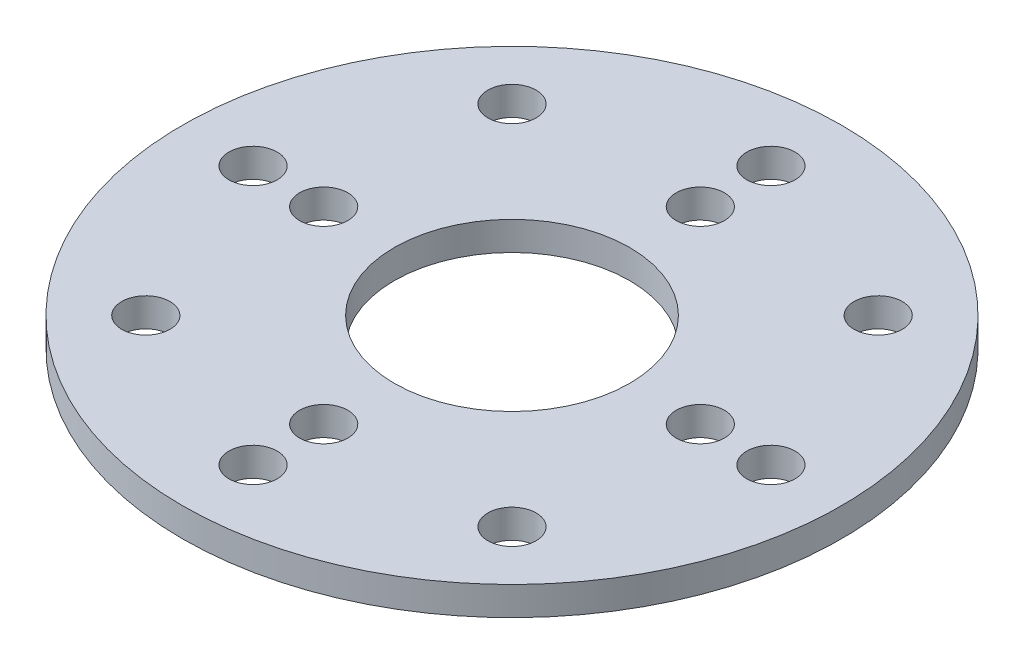
ISO-10303-21;
HEADER;
FILE_DESCRIPTION(('STEP AP214'),'2;1');
FILE_NAME('part.step','',(''),(''),'','','');
FILE_SCHEMA(('AUTOMOTIVE_DESIGN { 1 0 10303 214 1 1 1 1 }'));
ENDSEC;
DATA;
#1=APPLICATION_CONTEXT('core data for automotive mechanical design processes');
#2=APPLICATION_PROTOCOL_DEFINITION('international standard','automotive_design',2000,#1);
#3=PRODUCT_CONTEXT('',#1,'mechanical');
#4=PRODUCT('Part','Part','',(#3));
#5=PRODUCT_RELATED_PRODUCT_CATEGORY('part','',(#4));
#6=PRODUCT_DEFINITION_FORMATION('','',#4);
#7=PRODUCT_DEFINITION_CONTEXT('part definition',#1,'design');
#8=PRODUCT_DEFINITION('design','',#6,#7);
#9=PRODUCT_DEFINITION_SHAPE('','',#8);
#10=(LENGTH_UNIT() NAMED_UNIT(*) SI_UNIT(.MILLI.,.METRE.));
#11=(NAMED_UNIT(*) PLANE_ANGLE_UNIT() SI_UNIT($,.RADIAN.));
#12=(NAMED_UNIT(*) SI_UNIT($,.STERADIAN.) SOLID_ANGLE_UNIT());
#13=UNCERTAINTY_MEASURE_WITH_UNIT(LENGTH_MEASURE(1.E-05),#10,'distance_accuracy_value','');
#14=(GEOMETRIC_REPRESENTATION_CONTEXT(3) GLOBAL_UNCERTAINTY_ASSIGNED_CONTEXT((#13)) GLOBAL_UNIT_ASSIGNED_CONTEXT((#10,
#11,#12)) REPRESENTATION_CONTEXT('',''));
#15=CARTESIAN_POINT('',(0.,0.,0.));
#16=DIRECTION('',(0.,0.,1.));
#17=DIRECTION('',(1.,0.,0.));
#18=AXIS2_PLACEMENT_3D('',#15,#16,#17);
#19=CARTESIAN_POINT('',(0.,0.5,0.));
#20=DIRECTION('',(0.,1.,0.));
#21=DIRECTION('',(0.,0.,1.));
#22=AXIS2_PLACEMENT_3D('',#19,#20,#21);
#23=CYLINDRICAL_SURFACE('',#22,14.);
#24=CARTESIAN_POINT('',(0.,0.5,0.));
#25=DIRECTION('',(0.,1.,0.));
#26=DIRECTION('',(0.,0.,-1.));
#27=AXIS2_PLACEMENT_3D('',#24,#25,#26);
#28=CIRCLE('',#27,14.);
#29=CARTESIAN_POINT('',(0.,0.5,-14.));
#30=VERTEX_POINT('',#29);
#31=EDGE_CURVE('E10',#30,#30,#28,.T.);
#32=ORIENTED_EDGE('',*,*,#31,.T.);
#33=EDGE_LOOP('',(#32));
#34=FACE_BOUND('',#33,.T.);
#35=CARTESIAN_POINT('',(0.,1.72,0.));
#36=DIRECTION('',(0.,1.,0.));
#37=DIRECTION('',(0.,0.,-1.));
#38=AXIS2_PLACEMENT_3D('',#35,#36,#37);
#39=CIRCLE('',#38,14.);
#40=CARTESIAN_POINT('',(0.,1.72,-14.));
#41=VERTEX_POINT('',#40);
#42=EDGE_CURVE('E34',#41,#41,#39,.T.);
#43=ORIENTED_EDGE('',*,*,#42,.F.);
#44=EDGE_LOOP('',(#43));
#45=FACE_BOUND('',#44,.T.);
#46=ADVANCED_FACE('F31',(#34,#45),#23,.T.);
#47=CARTESIAN_POINT('',(0.,0.5,0.));
#48=DIRECTION('',(0.,-1.,0.));
#49=DIRECTION('',(0.,0.,-1.));
#50=AXIS2_PLACEMENT_3D('',#47,#48,#49);
#51=PLANE('',#50);
#52=CARTESIAN_POINT('',(0.,0.5,0.));
#53=DIRECTION('',(0.,1.,0.));
#54=DIRECTION('',(0.,0.,-1.));
#55=AXIS2_PLACEMENT_3D('',#52,#53,#54);
#56=CIRCLE('',#55,5.);
#57=CARTESIAN_POINT('',(0.,0.5,-5.));
#58=VERTEX_POINT('',#57);
#59=EDGE_CURVE('E112',#58,#58,#56,.T.);
#60=ORIENTED_EDGE('',*,*,#59,.T.);
#61=EDGE_LOOP('',(#60));
#62=FACE_BOUND('',#61,.T.);
#63=CARTESIAN_POINT('',(0.,0.5,8.));
#64=DIRECTION('',(0.,1.,0.));
#65=DIRECTION('',(0.,0.,-1.));
#66=AXIS2_PLACEMENT_3D('',#63,#64,#65);
#67=CIRCLE('',#66,1.02499999999999);
#68=CARTESIAN_POINT('',(0.,0.5,6.97500000000001));
#69=VERTEX_POINT('',#68);
#70=EDGE_CURVE('E106',#69,#69,#67,.T.);
#71=ORIENTED_EDGE('',*,*,#70,.T.);
#72=EDGE_LOOP('',(#71));
#73=FACE_BOUND('',#72,.T.);
#74=CARTESIAN_POINT('',(0.,0.5,-8.));
#75=DIRECTION('',(0.,1.,0.));
#76=DIRECTION('',(0.,0.,-1.));
#77=AXIS2_PLACEMENT_3D('',#74,#75,#76);
#78=CIRCLE('',#77,1.02499999999999);
#79=CARTESIAN_POINT('',(0.,0.5,-9.02499999999999));
#80=VERTEX_POINT('',#79);
#81=EDGE_CURVE('E100',#80,#80,#78,.T.);
#82=ORIENTED_EDGE('',*,*,#81,.T.);
#83=EDGE_LOOP('',(#82));
#84=FACE_BOUND('',#83,.T.);
#85=CARTESIAN_POINT('',(-11.,0.5,0.));
#86=DIRECTION('',(0.,1.,0.));
#87=DIRECTION('',(0.,0.,-1.));
#88=AXIS2_PLACEMENT_3D('',#85,#86,#87);
#89=CIRCLE('',#88,1.02499999999999);
#90=CARTESIAN_POINT('',(-11.,0.5,-1.02499999999999));
#91=VERTEX_POINT('',#90);
#92=EDGE_CURVE('E94',#91,#91,#89,.T.);
#93=ORIENTED_EDGE('',*,*,#92,.T.);
#94=EDGE_LOOP('',(#93));
#95=FACE_BOUND('',#94,.T.);
#96=CARTESIAN_POINT('',(0.,0.5,11.));
#97=DIRECTION('',(0.,1.,0.));
#98=DIRECTION('',(0.,0.,-1.));
#99=AXIS2_PLACEMENT_3D('',#96,#97,#98);
#100=CIRCLE('',#99,1.02499999999999);
#101=CARTESIAN_POINT('',(0.,0.5,9.97500000000001));
#102=VERTEX_POINT('',#101);
#103=EDGE_CURVE('E88',#102,#102,#100,.T.);
#104=ORIENTED_EDGE('',*,*,#103,.T.);
#105=EDGE_LOOP('',(#104));
#106=FACE_BOUND('',#105,.T.);
#107=CARTESIAN_POINT('',(11.,0.5,0.));
#108=DIRECTION('',(0.,1.,0.));
#109=DIRECTION('',(0.,0.,-1.));
#110=AXIS2_PLACEMENT_3D('',#107,#108,#109);
#111=CIRCLE('',#110,1.02499999999999);
#112=CARTESIAN_POINT('',(11.,0.5,-1.02499999999999));
#113=VERTEX_POINT('',#112);
#114=EDGE_CURVE('E82',#113,#113,#111,.T.);
#115=ORIENTED_EDGE('',*,*,#114,.T.);
#116=EDGE_LOOP('',(#115));
#117=FACE_BOUND('',#116,.T.);
#118=CARTESIAN_POINT('',(0.,0.5,-11.));
#119=DIRECTION('',(0.,1.,0.));
#120=DIRECTION('',(0.,0.,-1.));
#121=AXIS2_PLACEMENT_3D('',#118,#119,#120);
#122=CIRCLE('',#121,1.02499999999999);
#123=CARTESIAN_POINT('',(0.,0.5,-12.025));
#124=VERTEX_POINT('',#123);
#125=EDGE_CURVE('E76',#124,#124,#122,.T.);
#126=ORIENTED_EDGE('',*,*,#125,.T.);
#127=EDGE_LOOP('',(#126));
#128=FACE_BOUND('',#127,.T.);
#129=CARTESIAN_POINT('',(7.778174593052,0.5,-7.778174593052));
#130=DIRECTION('',(0.,1.,0.));
#131=DIRECTION('',(0.,0.,-1.));
#132=AXIS2_PLACEMENT_3D('',#129,#130,#131);
#133=CIRCLE('',#132,1.02499999999999);
#134=CARTESIAN_POINT('',(7.778174593052,0.5,-8.80317459305199));
#135=VERTEX_POINT('',#134);
#136=EDGE_CURVE('E70',#135,#135,#133,.T.);
#137=ORIENTED_EDGE('',*,*,#136,.T.);
#138=EDGE_LOOP('',(#137));
#139=FACE_BOUND('',#138,.T.);
#140=CARTESIAN_POINT('',(7.778174593052,0.5,7.778174593052));
#141=DIRECTION('',(0.,1.,0.));
#142=DIRECTION('',(0.,0.,-1.));
#143=AXIS2_PLACEMENT_3D('',#140,#141,#142);
#144=CIRCLE('',#143,1.02499999999999);
#145=CARTESIAN_POINT('',(7.778174593052,0.5,6.75317459305201));
#146=VERTEX_POINT('',#145);
#147=EDGE_CURVE('E64',#146,#146,#144,.T.);
#148=ORIENTED_EDGE('',*,*,#147,.T.);
#149=EDGE_LOOP('',(#148));
#150=FACE_BOUND('',#149,.T.);
#151=CARTESIAN_POINT('',(-7.778174593052,0.5,7.778174593052));
#152=DIRECTION('',(0.,1.,0.));
#153=DIRECTION('',(0.,0.,-1.));
#154=AXIS2_PLACEMENT_3D('',#151,#152,#153);
#155=CIRCLE('',#154,1.02499999999999);
#156=CARTESIAN_POINT('',(-7.778174593052,0.5,6.75317459305201));
#157=VERTEX_POINT('',#156);
#158=EDGE_CURVE('E58',#157,#157,#155,.T.);
#159=ORIENTED_EDGE('',*,*,#158,.T.);
#160=EDGE_LOOP('',(#159));
#161=FACE_BOUND('',#160,.T.);
#162=CARTESIAN_POINT('',(-7.778174593052,0.5,-7.778174593052));
#163=DIRECTION('',(0.,1.,0.));
#164=DIRECTION('',(0.,0.,-1.));
#165=AXIS2_PLACEMENT_3D('',#162,#163,#164);
#166=CIRCLE('',#165,1.02499999999999);
#167=CARTESIAN_POINT('',(-7.778174593052,0.5,-8.80317459305199));
#168=VERTEX_POINT('',#167);
#169=EDGE_CURVE('E52',#168,#168,#166,.T.);
#170=ORIENTED_EDGE('',*,*,#169,.T.);
#171=EDGE_LOOP('',(#170));
#172=FACE_BOUND('',#171,.T.);
#173=CARTESIAN_POINT('',(8.,0.5,0.));
#174=DIRECTION('',(0.,1.,0.));
#175=DIRECTION('',(0.,0.,-1.));
#176=AXIS2_PLACEMENT_3D('',#173,#174,#175);
#177=CIRCLE('',#176,1.02499999999999);
#178=CARTESIAN_POINT('',(8.,0.5,-1.02499999999999));
#179=VERTEX_POINT('',#178);
#180=EDGE_CURVE('E46',#179,#179,#177,.T.);
#181=ORIENTED_EDGE('',*,*,#180,.T.);
#182=EDGE_LOOP('',(#181));
#183=FACE_BOUND('',#182,.T.);
#184=CARTESIAN_POINT('',(-8.,0.5,0.));
#185=DIRECTION('',(0.,1.,0.));
#186=DIRECTION('',(0.,0.,-1.));
#187=AXIS2_PLACEMENT_3D('',#184,#185,#186);
#188=CIRCLE('',#187,1.02499999999999);
#189=CARTESIAN_POINT('',(-8.,0.5,-1.02499999999999));
#190=VERTEX_POINT('',#189);
#191=EDGE_CURVE('E41',#190,#190,#188,.T.);
#192=ORIENTED_EDGE('',*,*,#191,.T.);
#193=EDGE_LOOP('',(#192));
#194=FACE_BOUND('',#193,.T.);
#195=ORIENTED_EDGE('',*,*,#31,.F.);
#196=EDGE_LOOP('',(#195));
#197=FACE_BOUND('',#196,.T.);
#198=ADVANCED_FACE('F121',(#62,#73,#84,#95,#106,#117,#128,#139,#150,#161,#172,#183,#194,#197),
#51,.T.);
#199=CARTESIAN_POINT('',(0.,1.72,0.));
#200=DIRECTION('',(0.,-1.,0.));
#201=DIRECTION('',(0.,0.,-1.));
#202=AXIS2_PLACEMENT_3D('',#199,#200,#201);
#203=PLANE('',#202);
#204=CARTESIAN_POINT('',(0.,1.72,0.));
#205=DIRECTION('',(0.,1.,0.));
#206=DIRECTION('',(0.,0.,-1.));
#207=AXIS2_PLACEMENT_3D('',#204,#205,#206);
#208=CIRCLE('',#207,5.);
#209=CARTESIAN_POINT('',(0.,1.72,-5.));
#210=VERTEX_POINT('',#209);
#211=EDGE_CURVE('E115',#210,#210,#208,.T.);
#212=ORIENTED_EDGE('',*,*,#211,.F.);
#213=EDGE_LOOP('',(#212));
#214=FACE_BOUND('',#213,.T.);
#215=CARTESIAN_POINT('',(0.,1.72,8.));
#216=DIRECTION('',(0.,1.,0.));
#217=DIRECTION('',(0.,0.,-1.));
#218=AXIS2_PLACEMENT_3D('',#215,#216,#217);
#219=CIRCLE('',#218,1.02499999999999);
#220=CARTESIAN_POINT('',(0.,1.72,6.97500000000001));
#221=VERTEX_POINT('',#220);
#222=EDGE_CURVE('E109',#221,#221,#219,.T.);
#223=ORIENTED_EDGE('',*,*,#222,.F.);
#224=EDGE_LOOP('',(#223));
#225=FACE_BOUND('',#224,.T.);
#226=CARTESIAN_POINT('',(0.,1.72,-8.));
#227=DIRECTION('',(0.,1.,0.));
#228=DIRECTION('',(0.,0.,-1.));
#229=AXIS2_PLACEMENT_3D('',#226,#227,#228);
#230=CIRCLE('',#229,1.02499999999999);
#231=CARTESIAN_POINT('',(0.,1.72,-9.02499999999999));
#232=VERTEX_POINT('',#231);
#233=EDGE_CURVE('E103',#232,#232,#230,.T.);
#234=ORIENTED_EDGE('',*,*,#233,.F.);
#235=EDGE_LOOP('',(#234));
#236=FACE_BOUND('',#235,.T.);
#237=CARTESIAN_POINT('',(-11.,1.72,0.));
#238=DIRECTION('',(0.,1.,0.));
#239=DIRECTION('',(0.,0.,-1.));
#240=AXIS2_PLACEMENT_3D('',#237,#238,#239);
#241=CIRCLE('',#240,1.02499999999999);
#242=CARTESIAN_POINT('',(-11.,1.72,-1.02499999999999));
#243=VERTEX_POINT('',#242);
#244=EDGE_CURVE('E97',#243,#243,#241,.T.);
#245=ORIENTED_EDGE('',*,*,#244,.F.);
#246=EDGE_LOOP('',(#245));
#247=FACE_BOUND('',#246,.T.);
#248=CARTESIAN_POINT('',(0.,1.72,11.));
#249=DIRECTION('',(0.,1.,0.));
#250=DIRECTION('',(0.,0.,-1.));
#251=AXIS2_PLACEMENT_3D('',#248,#249,#250);
#252=CIRCLE('',#251,1.02499999999999);
#253=CARTESIAN_POINT('',(0.,1.72,9.97500000000001));
#254=VERTEX_POINT('',#253);
#255=EDGE_CURVE('E91',#254,#254,#252,.T.);
#256=ORIENTED_EDGE('',*,*,#255,.F.);
#257=EDGE_LOOP('',(#256));
#258=FACE_BOUND('',#257,.T.);
#259=CARTESIAN_POINT('',(11.,1.72,0.));
#260=DIRECTION('',(0.,1.,0.));
#261=DIRECTION('',(0.,0.,-1.));
#262=AXIS2_PLACEMENT_3D('',#259,#260,#261);
#263=CIRCLE('',#262,1.02499999999999);
#264=CARTESIAN_POINT('',(11.,1.72,-1.02499999999999));
#265=VERTEX_POINT('',#264);
#266=EDGE_CURVE('E85',#265,#265,#263,.T.);
#267=ORIENTED_EDGE('',*,*,#266,.F.);
#268=EDGE_LOOP('',(#267));
#269=FACE_BOUND('',#268,.T.);
#270=CARTESIAN_POINT('',(0.,1.72,-11.));
#271=DIRECTION('',(0.,1.,0.));
#272=DIRECTION('',(0.,0.,-1.));
#273=AXIS2_PLACEMENT_3D('',#270,#271,#272);
#274=CIRCLE('',#273,1.02499999999999);
#275=CARTESIAN_POINT('',(0.,1.72,-12.025));
#276=VERTEX_POINT('',#275);
#277=EDGE_CURVE('E79',#276,#276,#274,.T.);
#278=ORIENTED_EDGE('',*,*,#277,.F.);
#279=EDGE_LOOP('',(#278));
#280=FACE_BOUND('',#279,.T.);
#281=CARTESIAN_POINT('',(7.778174593052,1.72,-7.778174593052));
#282=DIRECTION('',(0.,1.,0.));
#283=DIRECTION('',(0.,0.,-1.));
#284=AXIS2_PLACEMENT_3D('',#281,#282,#283);
#285=CIRCLE('',#284,1.02499999999999);
#286=CARTESIAN_POINT('',(7.778174593052,1.72,-8.80317459305199));
#287=VERTEX_POINT('',#286);
#288=EDGE_CURVE('E73',#287,#287,#285,.T.);
#289=ORIENTED_EDGE('',*,*,#288,.F.);
#290=EDGE_LOOP('',(#289));
#291=FACE_BOUND('',#290,.T.);
#292=CARTESIAN_POINT('',(7.778174593052,1.72,7.778174593052));
#293=DIRECTION('',(0.,1.,0.));
#294=DIRECTION('',(0.,0.,-1.));
#295=AXIS2_PLACEMENT_3D('',#292,#293,#294);
#296=CIRCLE('',#295,1.02499999999999);
#297=CARTESIAN_POINT('',(7.778174593052,1.72,6.75317459305201));
#298=VERTEX_POINT('',#297);
#299=EDGE_CURVE('E67',#298,#298,#296,.T.);
#300=ORIENTED_EDGE('',*,*,#299,.F.);
#301=EDGE_LOOP('',(#300));
#302=FACE_BOUND('',#301,.T.);
#303=CARTESIAN_POINT('',(-7.778174593052,1.72,7.778174593052));
#304=DIRECTION('',(0.,1.,0.));
#305=DIRECTION('',(0.,0.,-1.));
#306=AXIS2_PLACEMENT_3D('',#303,#304,#305);
#307=CIRCLE('',#306,1.02499999999999);
#308=CARTESIAN_POINT('',(-7.778174593052,1.72,6.75317459305201));
#309=VERTEX_POINT('',#308);
#310=EDGE_CURVE('E61',#309,#309,#307,.T.);
#311=ORIENTED_EDGE('',*,*,#310,.F.);
#312=EDGE_LOOP('',(#311));
#313=FACE_BOUND('',#312,.T.);
#314=CARTESIAN_POINT('',(-7.778174593052,1.72,-7.778174593052));
#315=DIRECTION('',(0.,1.,0.));
#316=DIRECTION('',(0.,0.,-1.));
#317=AXIS2_PLACEMENT_3D('',#314,#315,#316);
#318=CIRCLE('',#317,1.02499999999999);
#319=CARTESIAN_POINT('',(-7.778174593052,1.72,-8.80317459305199));
#320=VERTEX_POINT('',#319);
#321=EDGE_CURVE('E55',#320,#320,#318,.T.);
#322=ORIENTED_EDGE('',*,*,#321,.F.);
#323=EDGE_LOOP('',(#322));
#324=FACE_BOUND('',#323,.T.);
#325=CARTESIAN_POINT('',(8.,1.72,0.));
#326=DIRECTION('',(0.,1.,0.));
#327=DIRECTION('',(0.,0.,-1.));
#328=AXIS2_PLACEMENT_3D('',#325,#326,#327);
#329=CIRCLE('',#328,1.02499999999999);
#330=CARTESIAN_POINT('',(8.,1.72,-1.02499999999999));
#331=VERTEX_POINT('',#330);
#332=EDGE_CURVE('E49',#331,#331,#329,.T.);
#333=ORIENTED_EDGE('',*,*,#332,.F.);
#334=EDGE_LOOP('',(#333));
#335=FACE_BOUND('',#334,.T.);
#336=CARTESIAN_POINT('',(-8.,1.72,0.));
#337=DIRECTION('',(0.,1.,0.));
#338=DIRECTION('',(0.,0.,-1.));
#339=AXIS2_PLACEMENT_3D('',#336,#337,#338);
#340=CIRCLE('',#339,1.02499999999999);
#341=CARTESIAN_POINT('',(-8.,1.72,-1.02499999999999));
#342=VERTEX_POINT('',#341);
#343=EDGE_CURVE('E43',#342,#342,#340,.T.);
#344=ORIENTED_EDGE('',*,*,#343,.F.);
#345=EDGE_LOOP('',(#344));
#346=FACE_BOUND('',#345,.T.);
#347=ORIENTED_EDGE('',*,*,#42,.T.);
#348=EDGE_LOOP('',(#347));
#349=FACE_BOUND('',#348,.T.);
#350=ADVANCED_FACE('F131',(#214,#225,#236,#247,#258,#269,#280,#291,#302,#313,#324,#335,#346,
#349),#203,.F.);
#351=CARTESIAN_POINT('',(-8.,0.5,0.));
#352=DIRECTION('',(0.,1.,0.));
#353=DIRECTION('',(0.,0.,1.));
#354=AXIS2_PLACEMENT_3D('',#351,#352,#353);
#355=CYLINDRICAL_SURFACE('',#354,1.02499999999999);
#356=ORIENTED_EDGE('',*,*,#191,.F.);
#357=EDGE_LOOP('',(#356));
#358=FACE_BOUND('',#357,.T.);
#359=ORIENTED_EDGE('',*,*,#343,.T.);
#360=EDGE_LOOP('',(#359));
#361=FACE_BOUND('',#360,.T.);
#362=ADVANCED_FACE('F134',(#358,#361),#355,.F.);
#363=CARTESIAN_POINT('',(8.,0.5,0.));
#364=DIRECTION('',(0.,1.,0.));
#365=DIRECTION('',(0.,0.,1.));
#366=AXIS2_PLACEMENT_3D('',#363,#364,#365);
#367=CYLINDRICAL_SURFACE('',#366,1.02499999999999);
#368=ORIENTED_EDGE('',*,*,#180,.F.);
#369=EDGE_LOOP('',(#368));
#370=FACE_BOUND('',#369,.T.);
#371=ORIENTED_EDGE('',*,*,#332,.T.);
#372=EDGE_LOOP('',(#371));
#373=FACE_BOUND('',#372,.T.);
#374=ADVANCED_FACE('F171',(#370,#373),#367,.F.);
#375=CARTESIAN_POINT('',(-7.778174593052,0.5,-7.778174593052));
#376=DIRECTION('',(0.,1.,0.));
#377=DIRECTION('',(0.,0.,1.));
#378=AXIS2_PLACEMENT_3D('',#375,#376,#377);
#379=CYLINDRICAL_SURFACE('',#378,1.02499999999999);
#380=ORIENTED_EDGE('',*,*,#169,.F.);
#381=EDGE_LOOP('',(#380));
#382=FACE_BOUND('',#381,.T.);
#383=ORIENTED_EDGE('',*,*,#321,.T.);
#384=EDGE_LOOP('',(#383));
#385=FACE_BOUND('',#384,.T.);
#386=ADVANCED_FACE('F175',(#382,#385),#379,.F.);
#387=CARTESIAN_POINT('',(-7.778174593052,0.5,7.778174593052));
#388=DIRECTION('',(0.,1.,0.));
#389=DIRECTION('',(0.,0.,1.));
#390=AXIS2_PLACEMENT_3D('',#387,#388,#389);
#391=CYLINDRICAL_SURFACE('',#390,1.02499999999999);
#392=ORIENTED_EDGE('',*,*,#158,.F.);
#393=EDGE_LOOP('',(#392));
#394=FACE_BOUND('',#393,.T.);
#395=ORIENTED_EDGE('',*,*,#310,.T.);
#396=EDGE_LOOP('',(#395));
#397=FACE_BOUND('',#396,.T.);
#398=ADVANCED_FACE('F179',(#394,#397),#391,.F.);
#399=CARTESIAN_POINT('',(7.778174593052,0.5,7.778174593052));
#400=DIRECTION('',(0.,1.,0.));
#401=DIRECTION('',(0.,0.,1.));
#402=AXIS2_PLACEMENT_3D('',#399,#400,#401);
#403=CYLINDRICAL_SURFACE('',#402,1.02499999999999);
#404=ORIENTED_EDGE('',*,*,#147,.F.);
#405=EDGE_LOOP('',(#404));
#406=FACE_BOUND('',#405,.T.);
#407=ORIENTED_EDGE('',*,*,#299,.T.);
#408=EDGE_LOOP('',(#407));
#409=FACE_BOUND('',#408,.T.);
#410=ADVANCED_FACE('F183',(#406,#409),#403,.F.);
#411=CARTESIAN_POINT('',(7.778174593052,0.5,-7.778174593052));
#412=DIRECTION('',(0.,1.,0.));
#413=DIRECTION('',(0.,0.,1.));
#414=AXIS2_PLACEMENT_3D('',#411,#412,#413);
#415=CYLINDRICAL_SURFACE('',#414,1.02499999999999);
#416=ORIENTED_EDGE('',*,*,#136,.F.);
#417=EDGE_LOOP('',(#416));
#418=FACE_BOUND('',#417,.T.);
#419=ORIENTED_EDGE('',*,*,#288,.T.);
#420=EDGE_LOOP('',(#419));
#421=FACE_BOUND('',#420,.T.);
#422=ADVANCED_FACE('F187',(#418,#421),#415,.F.);
#423=CARTESIAN_POINT('',(0.,0.5,-11.));
#424=DIRECTION('',(0.,1.,0.));
#425=DIRECTION('',(0.,0.,1.));
#426=AXIS2_PLACEMENT_3D('',#423,#424,#425);
#427=CYLINDRICAL_SURFACE('',#426,1.02499999999999);
#428=ORIENTED_EDGE('',*,*,#125,.F.);
#429=EDGE_LOOP('',(#428));
#430=FACE_BOUND('',#429,.T.);
#431=ORIENTED_EDGE('',*,*,#277,.T.);
#432=EDGE_LOOP('',(#431));
#433=FACE_BOUND('',#432,.T.);
#434=ADVANCED_FACE('F191',(#430,#433),#427,.F.);
#435=CARTESIAN_POINT('',(11.,0.5,0.));
#436=DIRECTION('',(0.,1.,0.));
#437=DIRECTION('',(0.,0.,1.));
#438=AXIS2_PLACEMENT_3D('',#435,#436,#437);
#439=CYLINDRICAL_SURFACE('',#438,1.02499999999999);
#440=ORIENTED_EDGE('',*,*,#114,.F.);
#441=EDGE_LOOP('',(#440));
#442=FACE_BOUND('',#441,.T.);
#443=ORIENTED_EDGE('',*,*,#266,.T.);
#444=EDGE_LOOP('',(#443));
#445=FACE_BOUND('',#444,.T.);
#446=ADVANCED_FACE('F195',(#442,#445),#439,.F.);
#447=CARTESIAN_POINT('',(0.,0.5,11.));
#448=DIRECTION('',(0.,1.,0.));
#449=DIRECTION('',(0.,0.,1.));
#450=AXIS2_PLACEMENT_3D('',#447,#448,#449);
#451=CYLINDRICAL_SURFACE('',#450,1.02499999999999);
#452=ORIENTED_EDGE('',*,*,#103,.F.);
#453=EDGE_LOOP('',(#452));
#454=FACE_BOUND('',#453,.T.);
#455=ORIENTED_EDGE('',*,*,#255,.T.);
#456=EDGE_LOOP('',(#455));
#457=FACE_BOUND('',#456,.T.);
#458=ADVANCED_FACE('F199',(#454,#457),#451,.F.);
#459=CARTESIAN_POINT('',(-11.,0.5,0.));
#460=DIRECTION('',(0.,1.,0.));
#461=DIRECTION('',(0.,0.,1.));
#462=AXIS2_PLACEMENT_3D('',#459,#460,#461);
#463=CYLINDRICAL_SURFACE('',#462,1.02499999999999);
#464=ORIENTED_EDGE('',*,*,#92,.F.);
#465=EDGE_LOOP('',(#464));
#466=FACE_BOUND('',#465,.T.);
#467=ORIENTED_EDGE('',*,*,#244,.T.);
#468=EDGE_LOOP('',(#467));
#469=FACE_BOUND('',#468,.T.);
#470=ADVANCED_FACE('F203',(#466,#469),#463,.F.);
#471=CARTESIAN_POINT('',(0.,0.5,-8.));
#472=DIRECTION('',(0.,1.,0.));
#473=DIRECTION('',(0.,0.,1.));
#474=AXIS2_PLACEMENT_3D('',#471,#472,#473);
#475=CYLINDRICAL_SURFACE('',#474,1.02499999999999);
#476=ORIENTED_EDGE('',*,*,#81,.F.);
#477=EDGE_LOOP('',(#476));
#478=FACE_BOUND('',#477,.T.);
#479=ORIENTED_EDGE('',*,*,#233,.T.);
#480=EDGE_LOOP('',(#479));
#481=FACE_BOUND('',#480,.T.);
#482=ADVANCED_FACE('F207',(#478,#481),#475,.F.);
#483=CARTESIAN_POINT('',(0.,0.5,8.));
#484=DIRECTION('',(0.,1.,0.));
#485=DIRECTION('',(0.,0.,1.));
#486=AXIS2_PLACEMENT_3D('',#483,#484,#485);
#487=CYLINDRICAL_SURFACE('',#486,1.02499999999999);
#488=ORIENTED_EDGE('',*,*,#70,.F.);
#489=EDGE_LOOP('',(#488));
#490=FACE_BOUND('',#489,.T.);
#491=ORIENTED_EDGE('',*,*,#222,.T.);
#492=EDGE_LOOP('',(#491));
#493=FACE_BOUND('',#492,.T.);
#494=ADVANCED_FACE('F127',(#490,#493),#487,.F.);
#495=CARTESIAN_POINT('',(0.,0.5,0.));
#496=DIRECTION('',(0.,1.,0.));
#497=DIRECTION('',(0.,0.,1.));
#498=AXIS2_PLACEMENT_3D('',#495,#496,#497);
#499=CYLINDRICAL_SURFACE('',#498,5.);
#500=ORIENTED_EDGE('',*,*,#59,.F.);
#501=EDGE_LOOP('',(#500));
#502=FACE_BOUND('',#501,.T.);
#503=ORIENTED_EDGE('',*,*,#211,.T.);
#504=EDGE_LOOP('',(#503));
#505=FACE_BOUND('',#504,.T.);
#506=ADVANCED_FACE('F124',(#502,#505),#499,.F.);
#507=CLOSED_SHELL('',(#46,#198,#350,#362,#374,#386,#398,#410,#422,#434,#446,#458,#470,#482,#494,#506));
#508=MANIFOLD_SOLID_BREP('B2',#507);
#509=ADVANCED_BREP_SHAPE_REPRESENTATION('',(#18,#508),#14);
#510=SHAPE_DEFINITION_REPRESENTATION(#9,#509);
ENDSEC;
END-ISO-10303-21;
